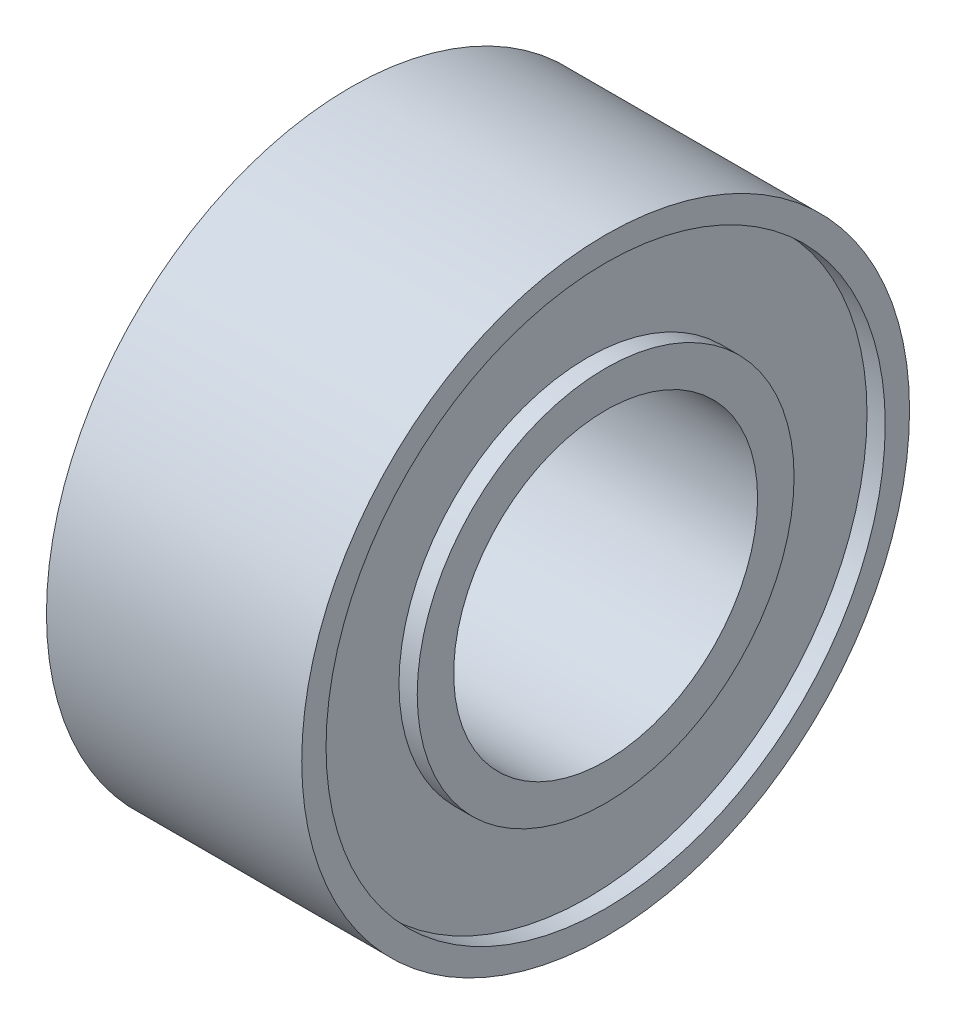
ISO-10303-21;
HEADER;
FILE_DESCRIPTION(('STEP AP214'),'2;1');
FILE_NAME('part.step','',(''),(''),'','','');
FILE_SCHEMA(('AUTOMOTIVE_DESIGN { 1 0 10303 214 1 1 1 1 }'));
ENDSEC;
DATA;
#1=APPLICATION_CONTEXT('core data for automotive mechanical design processes');
#2=APPLICATION_PROTOCOL_DEFINITION('international standard','automotive_design',2000,#1);
#3=PRODUCT_CONTEXT('',#1,'mechanical');
#4=PRODUCT('Part','Part','',(#3));
#5=PRODUCT_RELATED_PRODUCT_CATEGORY('part','',(#4));
#6=PRODUCT_DEFINITION_FORMATION('','',#4);
#7=PRODUCT_DEFINITION_CONTEXT('part definition',#1,'design');
#8=PRODUCT_DEFINITION('design','',#6,#7);
#9=PRODUCT_DEFINITION_SHAPE('','',#8);
#10=(LENGTH_UNIT() NAMED_UNIT(*) SI_UNIT(.MILLI.,.METRE.));
#11=(NAMED_UNIT(*) PLANE_ANGLE_UNIT() SI_UNIT($,.RADIAN.));
#12=(NAMED_UNIT(*) SI_UNIT($,.STERADIAN.) SOLID_ANGLE_UNIT());
#13=UNCERTAINTY_MEASURE_WITH_UNIT(LENGTH_MEASURE(1.E-05),#10,'distance_accuracy_value','');
#14=(GEOMETRIC_REPRESENTATION_CONTEXT(3) GLOBAL_UNCERTAINTY_ASSIGNED_CONTEXT((#13)) GLOBAL_UNIT_ASSIGNED_CONTEXT((#10,
#11,#12)) REPRESENTATION_CONTEXT('',''));
#15=CARTESIAN_POINT('',(0.,0.,0.));
#16=DIRECTION('',(0.,0.,1.));
#17=DIRECTION('',(1.,0.,0.));
#18=AXIS2_PLACEMENT_3D('',#15,#16,#17);
#19=CARTESIAN_POINT('',(-2.1,2.5,0.));
#20=DIRECTION('',(-1.,0.,0.));
#21=DIRECTION('',(0.,0.,1.));
#22=AXIS2_PLACEMENT_3D('',#19,#20,#21);
#23=PLANE('',#22);
#24=CARTESIAN_POINT('',(-2.1,0.,0.));
#25=DIRECTION('',(1.,0.,0.));
#26=DIRECTION('',(0.,0.,-1.));
#27=AXIS2_PLACEMENT_3D('',#24,#25,#26);
#28=CIRCLE('',#27,2.5);
#29=CARTESIAN_POINT('',(-2.1,0.,-2.5));
#30=VERTEX_POINT('',#29);
#31=EDGE_CURVE('E75',#30,#30,#28,.T.);
#32=ORIENTED_EDGE('',*,*,#31,.T.);
#33=EDGE_LOOP('',(#32));
#34=FACE_BOUND('',#33,.T.);
#35=CARTESIAN_POINT('',(-2.1,0.,0.));
#36=DIRECTION('',(1.,0.,0.));
#37=DIRECTION('',(0.,0.,-1.));
#38=AXIS2_PLACEMENT_3D('',#35,#36,#37);
#39=CIRCLE('',#38,3.1);
#40=CARTESIAN_POINT('',(-2.1,0.,-3.1));
#41=VERTEX_POINT('',#40);
#42=EDGE_CURVE('E10',#41,#41,#39,.T.);
#43=ORIENTED_EDGE('',*,*,#42,.F.);
#44=EDGE_LOOP('',(#43));
#45=FACE_BOUND('',#44,.T.);
#46=ADVANCED_FACE('F35',(#34,#45),#23,.T.);
#47=CARTESIAN_POINT('',(0.,0.,0.));
#48=DIRECTION('',(1.,0.,0.));
#49=DIRECTION('',(0.,0.,-1.));
#50=AXIS2_PLACEMENT_3D('',#47,#48,#49);
#51=CYLINDRICAL_SURFACE('',#50,3.1);
#52=ORIENTED_EDGE('',*,*,#42,.T.);
#53=EDGE_LOOP('',(#52));
#54=FACE_BOUND('',#53,.T.);
#55=CARTESIAN_POINT('',(-1.8,0.,0.));
#56=DIRECTION('',(1.,0.,0.));
#57=DIRECTION('',(0.,0.,-1.));
#58=AXIS2_PLACEMENT_3D('',#55,#56,#57);
#59=CIRCLE('',#58,3.1);
#60=CARTESIAN_POINT('',(-1.8,0.,-3.1));
#61=VERTEX_POINT('',#60);
#62=EDGE_CURVE('E41',#61,#61,#59,.T.);
#63=ORIENTED_EDGE('',*,*,#62,.F.);
#64=EDGE_LOOP('',(#63));
#65=FACE_BOUND('',#64,.T.);
#66=ADVANCED_FACE('F93',(#54,#65),#51,.T.);
#67=CARTESIAN_POINT('',(-1.8,3.1,0.));
#68=DIRECTION('',(-1.,0.,0.));
#69=DIRECTION('',(0.,0.,1.));
#70=AXIS2_PLACEMENT_3D('',#67,#68,#69);
#71=PLANE('',#70);
#72=ORIENTED_EDGE('',*,*,#62,.T.);
#73=EDGE_LOOP('',(#72));
#74=FACE_BOUND('',#73,.T.);
#75=CARTESIAN_POINT('',(-1.8,0.,0.));
#76=DIRECTION('',(1.,0.,0.));
#77=DIRECTION('',(0.,0.,-1.));
#78=AXIS2_PLACEMENT_3D('',#75,#76,#77);
#79=CIRCLE('',#78,4.6);
#80=CARTESIAN_POINT('',(-1.8,0.,-4.6));
#81=VERTEX_POINT('',#80);
#82=EDGE_CURVE('E45',#81,#81,#79,.T.);
#83=ORIENTED_EDGE('',*,*,#82,.F.);
#84=EDGE_LOOP('',(#83));
#85=FACE_BOUND('',#84,.T.);
#86=ADVANCED_FACE('F97',(#74,#85),#71,.T.);
#87=CARTESIAN_POINT('',(0.,0.,0.));
#88=DIRECTION('',(1.,0.,0.));
#89=DIRECTION('',(0.,0.,-1.));
#90=AXIS2_PLACEMENT_3D('',#87,#88,#89);
#91=CYLINDRICAL_SURFACE('',#90,4.6);
#92=ORIENTED_EDGE('',*,*,#82,.T.);
#93=EDGE_LOOP('',(#92));
#94=FACE_BOUND('',#93,.T.);
#95=CARTESIAN_POINT('',(-2.1,0.,0.));
#96=DIRECTION('',(1.,0.,0.));
#97=DIRECTION('',(0.,0.,-1.));
#98=AXIS2_PLACEMENT_3D('',#95,#96,#97);
#99=CIRCLE('',#98,4.6);
#100=CARTESIAN_POINT('',(-2.1,0.,-4.6));
#101=VERTEX_POINT('',#100);
#102=EDGE_CURVE('E49',#101,#101,#99,.T.);
#103=ORIENTED_EDGE('',*,*,#102,.F.);
#104=EDGE_LOOP('',(#103));
#105=FACE_BOUND('',#104,.T.);
#106=ADVANCED_FACE('F101',(#94,#105),#91,.F.);
#107=CARTESIAN_POINT('',(-2.1,4.6,0.));
#108=DIRECTION('',(-1.,0.,0.));
#109=DIRECTION('',(0.,0.,1.));
#110=AXIS2_PLACEMENT_3D('',#107,#108,#109);
#111=PLANE('',#110);
#112=ORIENTED_EDGE('',*,*,#102,.T.);
#113=EDGE_LOOP('',(#112));
#114=FACE_BOUND('',#113,.T.);
#115=CARTESIAN_POINT('',(-2.1,0.,0.));
#116=DIRECTION('',(1.,0.,0.));
#117=DIRECTION('',(0.,0.,-1.));
#118=AXIS2_PLACEMENT_3D('',#115,#116,#117);
#119=CIRCLE('',#118,5.);
#120=CARTESIAN_POINT('',(-2.1,0.,-5.));
#121=VERTEX_POINT('',#120);
#122=EDGE_CURVE('E54',#121,#121,#119,.T.);
#123=ORIENTED_EDGE('',*,*,#122,.F.);
#124=EDGE_LOOP('',(#123));
#125=FACE_BOUND('',#124,.T.);
#126=ADVANCED_FACE('F107',(#114,#125),#111,.T.);
#127=CARTESIAN_POINT('',(0.,0.,0.));
#128=DIRECTION('',(1.,0.,0.));
#129=DIRECTION('',(0.,0.,-1.));
#130=AXIS2_PLACEMENT_3D('',#127,#128,#129);
#131=CYLINDRICAL_SURFACE('',#130,5.);
#132=ORIENTED_EDGE('',*,*,#122,.T.);
#133=EDGE_LOOP('',(#132));
#134=FACE_BOUND('',#133,.T.);
#135=CARTESIAN_POINT('',(2.1,0.,0.));
#136=DIRECTION('',(1.,0.,0.));
#137=DIRECTION('',(0.,0.,-1.));
#138=AXIS2_PLACEMENT_3D('',#135,#136,#137);
#139=CIRCLE('',#138,5.);
#140=CARTESIAN_POINT('',(2.1,0.,-5.));
#141=VERTEX_POINT('',#140);
#142=EDGE_CURVE('E57',#141,#141,#139,.T.);
#143=ORIENTED_EDGE('',*,*,#142,.F.);
#144=EDGE_LOOP('',(#143));
#145=FACE_BOUND('',#144,.T.);
#146=ADVANCED_FACE('F111',(#134,#145),#131,.T.);
#147=CARTESIAN_POINT('',(2.1,4.6,0.));
#148=DIRECTION('',(1.,0.,0.));
#149=DIRECTION('',(0.,0.,-1.));
#150=AXIS2_PLACEMENT_3D('',#147,#148,#149);
#151=PLANE('',#150);
#152=ORIENTED_EDGE('',*,*,#142,.T.);
#153=EDGE_LOOP('',(#152));
#154=FACE_BOUND('',#153,.T.);
#155=CARTESIAN_POINT('',(2.1,0.,0.));
#156=DIRECTION('',(1.,0.,0.));
#157=DIRECTION('',(0.,0.,-1.));
#158=AXIS2_PLACEMENT_3D('',#155,#156,#157);
#159=CIRCLE('',#158,4.6);
#160=CARTESIAN_POINT('',(2.1,0.,-4.6));
#161=VERTEX_POINT('',#160);
#162=EDGE_CURVE('E60',#161,#161,#159,.T.);
#163=ORIENTED_EDGE('',*,*,#162,.F.);
#164=EDGE_LOOP('',(#163));
#165=FACE_BOUND('',#164,.T.);
#166=ADVANCED_FACE('F115',(#154,#165),#151,.T.);
#167=CARTESIAN_POINT('',(0.,0.,0.));
#168=DIRECTION('',(1.,0.,0.));
#169=DIRECTION('',(0.,0.,-1.));
#170=AXIS2_PLACEMENT_3D('',#167,#168,#169);
#171=CYLINDRICAL_SURFACE('',#170,4.6);
#172=ORIENTED_EDGE('',*,*,#162,.T.);
#173=EDGE_LOOP('',(#172));
#174=FACE_BOUND('',#173,.T.);
#175=CARTESIAN_POINT('',(1.8,0.,0.));
#176=DIRECTION('',(1.,0.,0.));
#177=DIRECTION('',(0.,0.,-1.));
#178=AXIS2_PLACEMENT_3D('',#175,#176,#177);
#179=CIRCLE('',#178,4.6);
#180=CARTESIAN_POINT('',(1.8,0.,-4.6));
#181=VERTEX_POINT('',#180);
#182=EDGE_CURVE('E63',#181,#181,#179,.T.);
#183=ORIENTED_EDGE('',*,*,#182,.F.);
#184=EDGE_LOOP('',(#183));
#185=FACE_BOUND('',#184,.T.);
#186=ADVANCED_FACE('F119',(#174,#185),#171,.F.);
#187=CARTESIAN_POINT('',(1.8,3.1,0.));
#188=DIRECTION('',(1.,0.,0.));
#189=DIRECTION('',(0.,0.,-1.));
#190=AXIS2_PLACEMENT_3D('',#187,#188,#189);
#191=PLANE('',#190);
#192=ORIENTED_EDGE('',*,*,#182,.T.);
#193=EDGE_LOOP('',(#192));
#194=FACE_BOUND('',#193,.T.);
#195=CARTESIAN_POINT('',(1.8,0.,0.));
#196=DIRECTION('',(1.,0.,0.));
#197=DIRECTION('',(0.,0.,-1.));
#198=AXIS2_PLACEMENT_3D('',#195,#196,#197);
#199=CIRCLE('',#198,3.1);
#200=CARTESIAN_POINT('',(1.8,0.,-3.1));
#201=VERTEX_POINT('',#200);
#202=EDGE_CURVE('E66',#201,#201,#199,.T.);
#203=ORIENTED_EDGE('',*,*,#202,.F.);
#204=EDGE_LOOP('',(#203));
#205=FACE_BOUND('',#204,.T.);
#206=ADVANCED_FACE('F123',(#194,#205),#191,.T.);
#207=CARTESIAN_POINT('',(0.,0.,0.));
#208=DIRECTION('',(1.,0.,0.));
#209=DIRECTION('',(0.,0.,-1.));
#210=AXIS2_PLACEMENT_3D('',#207,#208,#209);
#211=CYLINDRICAL_SURFACE('',#210,3.1);
#212=ORIENTED_EDGE('',*,*,#202,.T.);
#213=EDGE_LOOP('',(#212));
#214=FACE_BOUND('',#213,.T.);
#215=CARTESIAN_POINT('',(2.1,0.,0.));
#216=DIRECTION('',(1.,0.,0.));
#217=DIRECTION('',(0.,0.,-1.));
#218=AXIS2_PLACEMENT_3D('',#215,#216,#217);
#219=CIRCLE('',#218,3.1);
#220=CARTESIAN_POINT('',(2.1,0.,-3.1));
#221=VERTEX_POINT('',#220);
#222=EDGE_CURVE('E69',#221,#221,#219,.T.);
#223=ORIENTED_EDGE('',*,*,#222,.F.);
#224=EDGE_LOOP('',(#223));
#225=FACE_BOUND('',#224,.T.);
#226=ADVANCED_FACE('F89',(#214,#225),#211,.T.);
#227=CARTESIAN_POINT('',(2.1,2.5,0.));
#228=DIRECTION('',(1.,0.,0.));
#229=DIRECTION('',(0.,0.,-1.));
#230=AXIS2_PLACEMENT_3D('',#227,#228,#229);
#231=PLANE('',#230);
#232=ORIENTED_EDGE('',*,*,#222,.T.);
#233=EDGE_LOOP('',(#232));
#234=FACE_BOUND('',#233,.T.);
#235=CARTESIAN_POINT('',(2.1,0.,0.));
#236=DIRECTION('',(1.,0.,0.));
#237=DIRECTION('',(0.,0.,-1.));
#238=AXIS2_PLACEMENT_3D('',#235,#236,#237);
#239=CIRCLE('',#238,2.5);
#240=CARTESIAN_POINT('',(2.1,0.,-2.5));
#241=VERTEX_POINT('',#240);
#242=EDGE_CURVE('E72',#241,#241,#239,.T.);
#243=ORIENTED_EDGE('',*,*,#242,.F.);
#244=EDGE_LOOP('',(#243));
#245=FACE_BOUND('',#244,.T.);
#246=ADVANCED_FACE('F83',(#234,#245),#231,.T.);
#247=CARTESIAN_POINT('',(0.,0.,0.));
#248=DIRECTION('',(1.,0.,0.));
#249=DIRECTION('',(0.,0.,-1.));
#250=AXIS2_PLACEMENT_3D('',#247,#248,#249);
#251=CYLINDRICAL_SURFACE('',#250,2.5);
#252=ORIENTED_EDGE('',*,*,#242,.T.);
#253=EDGE_LOOP('',(#252));
#254=FACE_BOUND('',#253,.T.);
#255=ORIENTED_EDGE('',*,*,#31,.F.);
#256=EDGE_LOOP('',(#255));
#257=FACE_BOUND('',#256,.T.);
#258=ADVANCED_FACE('F81',(#254,#257),#251,.F.);
#259=CLOSED_SHELL('',(#46,#66,#86,#106,#126,#146,#166,#186,#206,#226,#246,#258));
#260=MANIFOLD_SOLID_BREP('B2',#259);
#261=ADVANCED_BREP_SHAPE_REPRESENTATION('',(#18,#260),#14);
#262=SHAPE_DEFINITION_REPRESENTATION(#9,#261);
ENDSEC;
END-ISO-10303-21;
